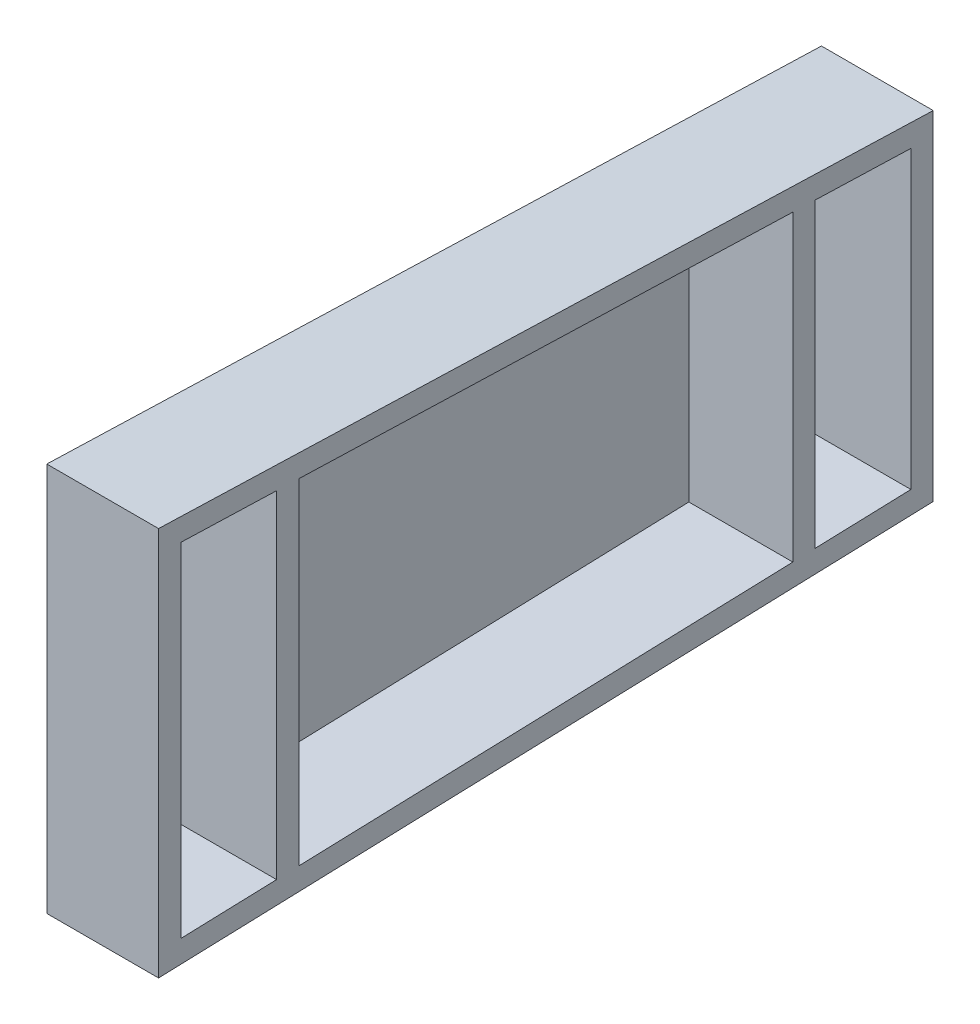
ISO-10303-21;
HEADER;
FILE_DESCRIPTION(('STEP AP214'),'2;1');
FILE_NAME('part.step','',(''),(''),'','','');
FILE_SCHEMA(('AUTOMOTIVE_DESIGN { 1 0 10303 214 1 1 1 1 }'));
ENDSEC;
DATA;
#1=APPLICATION_CONTEXT('core data for automotive mechanical design processes');
#2=APPLICATION_PROTOCOL_DEFINITION('international standard','automotive_design',2000,#1);
#3=PRODUCT_CONTEXT('',#1,'mechanical');
#4=PRODUCT('Part','Part','',(#3));
#5=PRODUCT_RELATED_PRODUCT_CATEGORY('part','',(#4));
#6=PRODUCT_DEFINITION_FORMATION('','',#4);
#7=PRODUCT_DEFINITION_CONTEXT('part definition',#1,'design');
#8=PRODUCT_DEFINITION('design','',#6,#7);
#9=PRODUCT_DEFINITION_SHAPE('','',#8);
#10=(LENGTH_UNIT() NAMED_UNIT(*) SI_UNIT(.MILLI.,.METRE.));
#11=(NAMED_UNIT(*) PLANE_ANGLE_UNIT() SI_UNIT($,.RADIAN.));
#12=(NAMED_UNIT(*) SI_UNIT($,.STERADIAN.) SOLID_ANGLE_UNIT());
#13=UNCERTAINTY_MEASURE_WITH_UNIT(LENGTH_MEASURE(1.E-05),#10,'distance_accuracy_value','');
#14=(GEOMETRIC_REPRESENTATION_CONTEXT(3) GLOBAL_UNCERTAINTY_ASSIGNED_CONTEXT((#13)) GLOBAL_UNIT_ASSIGNED_CONTEXT((#10,
#11,#12)) REPRESENTATION_CONTEXT('',''));
#15=CARTESIAN_POINT('',(0.,0.,0.));
#16=DIRECTION('',(0.,0.,1.));
#17=DIRECTION('',(1.,0.,0.));
#18=AXIS2_PLACEMENT_3D('',#15,#16,#17);
#19=CARTESIAN_POINT('',(3.,0.,0.));
#20=DIRECTION('',(1.,0.,0.));
#21=DIRECTION('',(0.,0.,-1.));
#22=AXIS2_PLACEMENT_3D('',#19,#20,#21);
#23=PLANE('',#22);
#24=DIRECTION('',(0.,0.0326503679022891,-0.999466834605253));
#25=VECTOR('',#24,1.);
#26=CARTESIAN_POINT('',(3.,-56.8109429530201,-289.4));
#27=LINE('',#26,#25);
#28=CARTESIAN_POINT('',(3.,-58.0131174496644,-252.6));
#29=VERTEX_POINT('',#28);
#30=CARTESIAN_POINT('',(3.,-56.8109429530201,-289.4));
#31=VERTEX_POINT('',#30);
#32=EDGE_CURVE('E188',#29,#31,#27,.T.);
#33=ORIENTED_EDGE('',*,*,#32,.T.);
#34=DIRECTION('',(0.,-1.,0.));
#35=VECTOR('',#34,1.);
#36=CARTESIAN_POINT('',(3.,56.8109429530201,-289.4));
#37=LINE('',#36,#35);
#38=CARTESIAN_POINT('',(3.,56.8109429530201,-289.4));
#39=VERTEX_POINT('',#38);
#40=EDGE_CURVE('E51',#39,#31,#37,.T.);
#41=ORIENTED_EDGE('',*,*,#40,.F.);
#42=DIRECTION('',(0.,-0.0326503679022891,-0.999466834605253));
#43=VECTOR('',#42,1.);
#44=CARTESIAN_POINT('',(3.,56.8109429530201,-289.4));
#45=LINE('',#44,#43);
#46=CARTESIAN_POINT('',(3.,58.0131174496644,-252.6));
#47=VERTEX_POINT('',#46);
#48=EDGE_CURVE('E55',#47,#39,#45,.T.);
#49=ORIENTED_EDGE('',*,*,#48,.F.);
#50=DIRECTION('',(0.,1.,0.));
#51=VECTOR('',#50,1.);
#52=CARTESIAN_POINT('',(3.,58.0131174496644,-252.6));
#53=LINE('',#52,#51);
#54=EDGE_CURVE('E246',#29,#47,#53,.T.);
#55=ORIENTED_EDGE('',*,*,#54,.F.);
#56=EDGE_LOOP('',(#33,#41,#49,#55));
#57=FACE_BOUND('',#56,.T.);
#58=ADVANCED_FACE('F36',(#57),#23,.T.);
#59=DIRECTION('',(0.,0.0326503679022891,-0.999466834605254));
#60=VECTOR('',#59,1.);
#61=CARTESIAN_POINT('',(3.,-58.2940604026846,-244.));
#62=LINE('',#61,#60);
#63=CARTESIAN_POINT('',(3.,-64.5009395973154,-54.));
#64=VERTEX_POINT('',#63);
#65=CARTESIAN_POINT('',(3.,-58.2940604026846,-244.));
#66=VERTEX_POINT('',#65);
#67=EDGE_CURVE('E179',#64,#66,#62,.T.);
#68=ORIENTED_EDGE('',*,*,#67,.T.);
#69=DIRECTION('',(0.,-1.,0.));
#70=VECTOR('',#69,1.);
#71=CARTESIAN_POINT('',(3.,58.2940604026846,-244.));
#72=LINE('',#71,#70);
#73=CARTESIAN_POINT('',(3.,58.2940604026846,-244.));
#74=VERTEX_POINT('',#73);
#75=EDGE_CURVE('E244',#74,#66,#72,.T.);
#76=ORIENTED_EDGE('',*,*,#75,.F.);
#77=DIRECTION('',(0.,-0.0326503679022891,-0.999466834605254));
#78=VECTOR('',#77,1.);
#79=CARTESIAN_POINT('',(3.,58.2940604026846,-244.));
#80=LINE('',#79,#78);
#81=CARTESIAN_POINT('',(3.,64.5009395973154,-54.));
#82=VERTEX_POINT('',#81);
#83=EDGE_CURVE('E241',#82,#74,#80,.T.);
#84=ORIENTED_EDGE('',*,*,#83,.F.);
#85=DIRECTION('',(0.,1.,0.));
#86=VECTOR('',#85,1.);
#87=CARTESIAN_POINT('',(3.,0.,-54.));
#88=LINE('',#87,#86);
#89=EDGE_CURVE('E238',#64,#82,#88,.T.);
#90=ORIENTED_EDGE('',*,*,#89,.F.);
#91=EDGE_LOOP('',(#68,#76,#84,#90));
#92=FACE_BOUND('',#91,.T.);
#93=ADVANCED_FACE('F288',(#92),#23,.T.);
#94=CARTESIAN_POINT('',(3.,-65.13,-298.));
#95=DIRECTION('',(0.,0.999466834605253,0.0326503679022891));
#96=DIRECTION('',(0.,-0.0326503679022891,0.999466834605254));
#97=AXIS2_PLACEMENT_3D('',#94,#95,#96);
#98=PLANE('',#97);
#99=DIRECTION('',(0.,0.0326503679022891,-0.999466834605254));
#100=VECTOR('',#99,1.);
#101=CARTESIAN_POINT('',(0.,-65.13,-298.));
#102=LINE('',#101,#100);
#103=CARTESIAN_POINT('',(0.,-74.865,0.));
#104=VERTEX_POINT('',#103);
#105=CARTESIAN_POINT('',(0.,-65.13,-298.));
#106=VERTEX_POINT('',#105);
#107=EDGE_CURVE('E267',#104,#106,#102,.T.);
#108=ORIENTED_EDGE('',*,*,#107,.T.);
#109=DIRECTION('',(-1.,0.,0.));
#110=VECTOR('',#109,1.);
#111=CARTESIAN_POINT('',(3.,-65.13,-298.));
#112=LINE('',#111,#110);
#113=CARTESIAN_POINT('',(43.,-65.13,-298.));
#114=VERTEX_POINT('',#113);
#115=EDGE_CURVE('E11',#114,#106,#112,.T.);
#116=ORIENTED_EDGE('',*,*,#115,.F.);
#117=DIRECTION('',(0.,-0.0326503679022891,0.999466834605254));
#118=VECTOR('',#117,1.);
#119=CARTESIAN_POINT('',(43.,-74.865,0.));
#120=LINE('',#119,#118);
#121=CARTESIAN_POINT('',(43.,-74.865,0.));
#122=VERTEX_POINT('',#121);
#123=EDGE_CURVE('E166',#114,#122,#120,.T.);
#124=ORIENTED_EDGE('',*,*,#123,.T.);
#125=DIRECTION('',(-1.,0.,0.));
#126=VECTOR('',#125,1.);
#127=CARTESIAN_POINT('',(3.,-74.865,0.));
#128=LINE('',#127,#126);
#129=EDGE_CURVE('E147',#122,#104,#128,.T.);
#130=ORIENTED_EDGE('',*,*,#129,.T.);
#131=EDGE_LOOP('',(#108,#116,#124,#130));
#132=FACE_BOUND('',#131,.T.);
#133=ADVANCED_FACE('F38',(#132),#98,.F.);
#134=CARTESIAN_POINT('',(3.,65.13,-298.));
#135=DIRECTION('',(0.,0.,1.));
#136=DIRECTION('',(1.,0.,0.));
#137=AXIS2_PLACEMENT_3D('',#134,#135,#136);
#138=PLANE('',#137);
#139=DIRECTION('',(0.,1.,0.));
#140=VECTOR('',#139,1.);
#141=CARTESIAN_POINT('',(0.,65.13,-298.));
#142=LINE('',#141,#140);
#143=CARTESIAN_POINT('',(0.,65.13,-298.));
#144=VERTEX_POINT('',#143);
#145=EDGE_CURVE('E269',#106,#144,#142,.T.);
#146=ORIENTED_EDGE('',*,*,#145,.T.);
#147=DIRECTION('',(-1.,0.,0.));
#148=VECTOR('',#147,1.);
#149=CARTESIAN_POINT('',(3.,65.13,-298.));
#150=LINE('',#149,#148);
#151=CARTESIAN_POINT('',(43.,65.13,-298.));
#152=VERTEX_POINT('',#151);
#153=EDGE_CURVE('E44',#152,#144,#150,.T.);
#154=ORIENTED_EDGE('',*,*,#153,.F.);
#155=DIRECTION('',(0.,1.,0.));
#156=VECTOR('',#155,1.);
#157=CARTESIAN_POINT('',(43.,0.,-298.));
#158=LINE('',#157,#156);
#159=EDGE_CURVE('E227',#114,#152,#158,.T.);
#160=ORIENTED_EDGE('',*,*,#159,.F.);
#161=ORIENTED_EDGE('',*,*,#115,.T.);
#162=EDGE_LOOP('',(#146,#154,#160,#161));
#163=FACE_BOUND('',#162,.T.);
#164=ADVANCED_FACE('F281',(#163),#138,.F.);
#165=CARTESIAN_POINT('',(3.,74.865,0.));
#166=DIRECTION('',(0.,-0.999466834605253,0.0326503679022891));
#167=DIRECTION('',(0.,-0.0326503679022891,-0.999466834605254));
#168=AXIS2_PLACEMENT_3D('',#165,#166,#167);
#169=PLANE('',#168);
#170=DIRECTION('',(0.,0.0326503679022891,0.999466834605254));
#171=VECTOR('',#170,1.);
#172=CARTESIAN_POINT('',(0.,74.865,0.));
#173=LINE('',#172,#171);
#174=CARTESIAN_POINT('',(0.,74.865,0.));
#175=VERTEX_POINT('',#174);
#176=EDGE_CURVE('E271',#144,#175,#173,.T.);
#177=ORIENTED_EDGE('',*,*,#176,.T.);
#178=DIRECTION('',(-1.,0.,0.));
#179=VECTOR('',#178,1.);
#180=CARTESIAN_POINT('',(3.,74.865,0.));
#181=LINE('',#180,#179);
#182=CARTESIAN_POINT('',(43.,74.865,0.));
#183=VERTEX_POINT('',#182);
#184=EDGE_CURVE('E158',#183,#175,#181,.T.);
#185=ORIENTED_EDGE('',*,*,#184,.F.);
#186=DIRECTION('',(0.,0.0326503679022891,0.999466834605254));
#187=VECTOR('',#186,1.);
#188=CARTESIAN_POINT('',(43.,74.865,0.));
#189=LINE('',#188,#187);
#190=EDGE_CURVE('E168',#152,#183,#189,.T.);
#191=ORIENTED_EDGE('',*,*,#190,.F.);
#192=ORIENTED_EDGE('',*,*,#153,.T.);
#193=EDGE_LOOP('',(#177,#185,#191,#192));
#194=FACE_BOUND('',#193,.T.);
#195=ADVANCED_FACE('F277',(#194),#169,.F.);
#196=CARTESIAN_POINT('',(3.,74.865,0.));
#197=DIRECTION('',(0.,0.,-1.));
#198=DIRECTION('',(-1.,0.,0.));
#199=AXIS2_PLACEMENT_3D('',#196,#197,#198);
#200=PLANE('',#199);
#201=ORIENTED_EDGE('',*,*,#129,.F.);
#202=DIRECTION('',(0.,-1.,0.));
#203=VECTOR('',#202,1.);
#204=CARTESIAN_POINT('',(43.,66.265,0.));
#205=LINE('',#204,#203);
#206=EDGE_CURVE('E151',#183,#122,#205,.T.);
#207=ORIENTED_EDGE('',*,*,#206,.F.);
#208=ORIENTED_EDGE('',*,*,#184,.T.);
#209=DIRECTION('',(0.,-1.,0.));
#210=VECTOR('',#209,1.);
#211=CARTESIAN_POINT('',(0.,74.865,0.));
#212=LINE('',#211,#210);
#213=EDGE_CURVE('E153',#175,#104,#212,.T.);
#214=ORIENTED_EDGE('',*,*,#213,.T.);
#215=EDGE_LOOP('',(#201,#207,#208,#214));
#216=FACE_BOUND('',#215,.T.);
#217=ADVANCED_FACE('F149',(#216),#200,.F.);
#218=DIRECTION('',(0.,0.0326503679022895,-0.999466834605253));
#219=VECTOR('',#218,1.);
#220=CARTESIAN_POINT('',(3.,-64.7818825503356,-45.4));
#221=LINE('',#220,#219);
#222=CARTESIAN_POINT('',(3.,-65.9840570469799,-8.60000000000001));
#223=VERTEX_POINT('',#222);
#224=CARTESIAN_POINT('',(3.,-64.7818825503356,-45.4));
#225=VERTEX_POINT('',#224);
#226=EDGE_CURVE('E173',#223,#225,#221,.T.);
#227=ORIENTED_EDGE('',*,*,#226,.T.);
#228=DIRECTION('',(0.,-1.,0.));
#229=VECTOR('',#228,1.);
#230=CARTESIAN_POINT('',(3.,0.,-45.4));
#231=LINE('',#230,#229);
#232=CARTESIAN_POINT('',(3.,64.7818825503356,-45.4));
#233=VERTEX_POINT('',#232);
#234=EDGE_CURVE('E236',#233,#225,#231,.T.);
#235=ORIENTED_EDGE('',*,*,#234,.F.);
#236=DIRECTION('',(0.,-0.0326503679022895,-0.999466834605253));
#237=VECTOR('',#236,1.);
#238=CARTESIAN_POINT('',(3.,64.7818825503356,-45.4));
#239=LINE('',#238,#237);
#240=CARTESIAN_POINT('',(3.,65.9840570469799,-8.60000000000001));
#241=VERTEX_POINT('',#240);
#242=EDGE_CURVE('E233',#241,#233,#239,.T.);
#243=ORIENTED_EDGE('',*,*,#242,.F.);
#244=DIRECTION('',(0.,1.,0.));
#245=VECTOR('',#244,1.);
#246=CARTESIAN_POINT('',(3.,0.,-8.60000000000001));
#247=LINE('',#246,#245);
#248=EDGE_CURVE('E208',#223,#241,#247,.T.);
#249=ORIENTED_EDGE('',*,*,#248,.F.);
#250=EDGE_LOOP('',(#227,#235,#243,#249));
#251=FACE_BOUND('',#250,.T.);
#252=ADVANCED_FACE('F291',(#251),#23,.T.);
#253=CARTESIAN_POINT('',(0.,0.,0.));
#254=DIRECTION('',(1.,0.,0.));
#255=DIRECTION('',(0.,0.,-1.));
#256=AXIS2_PLACEMENT_3D('',#253,#254,#255);
#257=PLANE('',#256);
#258=ORIENTED_EDGE('',*,*,#107,.F.);
#259=ORIENTED_EDGE('',*,*,#213,.F.);
#260=ORIENTED_EDGE('',*,*,#176,.F.);
#261=ORIENTED_EDGE('',*,*,#145,.F.);
#262=EDGE_LOOP('',(#258,#259,#260,#261));
#263=FACE_BOUND('',#262,.T.);
#264=ADVANCED_FACE('F280',(#263),#257,.F.);
#265=CARTESIAN_POINT('',(43.,0.,-8.60000000000001));
#266=DIRECTION('',(0.,0.,1.));
#267=DIRECTION('',(1.,0.,0.));
#268=AXIS2_PLACEMENT_3D('',#265,#266,#267);
#269=PLANE('',#268);
#270=ORIENTED_EDGE('',*,*,#248,.T.);
#271=DIRECTION('',(-1.,0.,0.));
#272=VECTOR('',#271,1.);
#273=CARTESIAN_POINT('',(43.,65.9840570469799,-8.60000000000001));
#274=LINE('',#273,#272);
#275=CARTESIAN_POINT('',(43.,65.9840570469799,-8.60000000000001));
#276=VERTEX_POINT('',#275);
#277=EDGE_CURVE('E264',#276,#241,#274,.T.);
#278=ORIENTED_EDGE('',*,*,#277,.F.);
#279=DIRECTION('',(0.,1.,0.));
#280=VECTOR('',#279,1.);
#281=CARTESIAN_POINT('',(43.,0.,-8.60000000000001));
#282=LINE('',#281,#280);
#283=CARTESIAN_POINT('',(43.,-65.9840570469799,-8.60000000000001));
#284=VERTEX_POINT('',#283);
#285=EDGE_CURVE('E169',#284,#276,#282,.T.);
#286=ORIENTED_EDGE('',*,*,#285,.F.);
#287=DIRECTION('',(-1.,0.,0.));
#288=VECTOR('',#287,1.);
#289=CARTESIAN_POINT('',(43.,-65.9840570469799,-8.60000000000001));
#290=LINE('',#289,#288);
#291=EDGE_CURVE('E187',#284,#223,#290,.T.);
#292=ORIENTED_EDGE('',*,*,#291,.T.);
#293=EDGE_LOOP('',(#270,#278,#286,#292));
#294=FACE_BOUND('',#293,.T.);
#295=ADVANCED_FACE('F304',(#294),#269,.F.);
#296=CARTESIAN_POINT('',(43.,64.7818825503356,-45.4));
#297=DIRECTION('',(0.,0.999466834605254,-0.0326503679022895));
#298=DIRECTION('',(0.,0.0326503679022895,0.999466834605254));
#299=AXIS2_PLACEMENT_3D('',#296,#297,#298);
#300=PLANE('',#299);
#301=ORIENTED_EDGE('',*,*,#242,.T.);
#302=DIRECTION('',(-1.,0.,0.));
#303=VECTOR('',#302,1.);
#304=CARTESIAN_POINT('',(43.,64.7818825503356,-45.4));
#305=LINE('',#304,#303);
#306=CARTESIAN_POINT('',(43.,64.7818825503356,-45.4));
#307=VERTEX_POINT('',#306);
#308=EDGE_CURVE('E261',#307,#233,#305,.T.);
#309=ORIENTED_EDGE('',*,*,#308,.F.);
#310=DIRECTION('',(0.,-0.0326503679022895,-0.999466834605253));
#311=VECTOR('',#310,1.);
#312=CARTESIAN_POINT('',(43.,64.7818825503356,-45.4));
#313=LINE('',#312,#311);
#314=EDGE_CURVE('E211',#276,#307,#313,.T.);
#315=ORIENTED_EDGE('',*,*,#314,.F.);
#316=ORIENTED_EDGE('',*,*,#277,.T.);
#317=EDGE_LOOP('',(#301,#309,#315,#316));
#318=FACE_BOUND('',#317,.T.);
#319=ADVANCED_FACE('F318',(#318),#300,.F.);
#320=CARTESIAN_POINT('',(43.,0.,-45.4));
#321=DIRECTION('',(0.,0.,-1.));
#322=DIRECTION('',(-1.,0.,0.));
#323=AXIS2_PLACEMENT_3D('',#320,#321,#322);
#324=PLANE('',#323);
#325=ORIENTED_EDGE('',*,*,#234,.T.);
#326=DIRECTION('',(-1.,0.,0.));
#327=VECTOR('',#326,1.);
#328=CARTESIAN_POINT('',(43.,-64.7818825503356,-45.4));
#329=LINE('',#328,#327);
#330=CARTESIAN_POINT('',(43.,-64.7818825503356,-45.4));
#331=VERTEX_POINT('',#330);
#332=EDGE_CURVE('E194',#331,#225,#329,.T.);
#333=ORIENTED_EDGE('',*,*,#332,.F.);
#334=DIRECTION('',(0.,-1.,0.));
#335=VECTOR('',#334,1.);
#336=CARTESIAN_POINT('',(43.,0.,-45.4));
#337=LINE('',#336,#335);
#338=EDGE_CURVE('E213',#307,#331,#337,.T.);
#339=ORIENTED_EDGE('',*,*,#338,.F.);
#340=ORIENTED_EDGE('',*,*,#308,.T.);
#341=EDGE_LOOP('',(#325,#333,#339,#340));
#342=FACE_BOUND('',#341,.T.);
#343=ADVANCED_FACE('F314',(#342),#324,.F.);
#344=CARTESIAN_POINT('',(43.,0.,-54.));
#345=DIRECTION('',(0.,0.,1.));
#346=DIRECTION('',(1.,0.,0.));
#347=AXIS2_PLACEMENT_3D('',#344,#345,#346);
#348=PLANE('',#347);
#349=ORIENTED_EDGE('',*,*,#89,.T.);
#350=DIRECTION('',(-1.,0.,0.));
#351=VECTOR('',#350,1.);
#352=CARTESIAN_POINT('',(43.,64.5009395973154,-54.));
#353=LINE('',#352,#351);
#354=CARTESIAN_POINT('',(43.,64.5009395973154,-54.));
#355=VERTEX_POINT('',#354);
#356=EDGE_CURVE('E258',#355,#82,#353,.T.);
#357=ORIENTED_EDGE('',*,*,#356,.F.);
#358=DIRECTION('',(0.,1.,0.));
#359=VECTOR('',#358,1.);
#360=CARTESIAN_POINT('',(43.,0.,-54.));
#361=LINE('',#360,#359);
#362=CARTESIAN_POINT('',(43.,-64.5009395973154,-54.));
#363=VERTEX_POINT('',#362);
#364=EDGE_CURVE('E215',#363,#355,#361,.T.);
#365=ORIENTED_EDGE('',*,*,#364,.F.);
#366=DIRECTION('',(-1.,0.,0.));
#367=VECTOR('',#366,1.);
#368=CARTESIAN_POINT('',(43.,-64.5009395973154,-54.));
#369=LINE('',#368,#367);
#370=EDGE_CURVE('E197',#363,#64,#369,.T.);
#371=ORIENTED_EDGE('',*,*,#370,.T.);
#372=EDGE_LOOP('',(#349,#357,#365,#371));
#373=FACE_BOUND('',#372,.T.);
#374=ADVANCED_FACE('F352',(#373),#348,.F.);
#375=CARTESIAN_POINT('',(43.,58.2940604026846,-244.));
#376=DIRECTION('',(0.,0.999466834605254,-0.0326503679022891));
#377=DIRECTION('',(0.,0.0326503679022891,0.999466834605254));
#378=AXIS2_PLACEMENT_3D('',#375,#376,#377);
#379=PLANE('',#378);
#380=ORIENTED_EDGE('',*,*,#83,.T.);
#381=DIRECTION('',(-1.,0.,0.));
#382=VECTOR('',#381,1.);
#383=CARTESIAN_POINT('',(43.,58.2940604026846,-244.));
#384=LINE('',#383,#382);
#385=CARTESIAN_POINT('',(43.,58.2940604026846,-244.));
#386=VERTEX_POINT('',#385);
#387=EDGE_CURVE('E255',#386,#74,#384,.T.);
#388=ORIENTED_EDGE('',*,*,#387,.F.);
#389=DIRECTION('',(0.,-0.0326503679022891,-0.999466834605254));
#390=VECTOR('',#389,1.);
#391=CARTESIAN_POINT('',(43.,58.2940604026846,-244.));
#392=LINE('',#391,#390);
#393=EDGE_CURVE('E217',#355,#386,#392,.T.);
#394=ORIENTED_EDGE('',*,*,#393,.F.);
#395=ORIENTED_EDGE('',*,*,#356,.T.);
#396=EDGE_LOOP('',(#380,#388,#394,#395));
#397=FACE_BOUND('',#396,.T.);
#398=ADVANCED_FACE('F348',(#397),#379,.F.);
#399=CARTESIAN_POINT('',(43.,58.2940604026846,-244.));
#400=DIRECTION('',(0.,0.,-1.));
#401=DIRECTION('',(-1.,0.,0.));
#402=AXIS2_PLACEMENT_3D('',#399,#400,#401);
#403=PLANE('',#402);
#404=ORIENTED_EDGE('',*,*,#75,.T.);
#405=DIRECTION('',(-1.,0.,0.));
#406=VECTOR('',#405,1.);
#407=CARTESIAN_POINT('',(43.,-58.2940604026846,-244.));
#408=LINE('',#407,#406);
#409=CARTESIAN_POINT('',(43.,-58.2940604026846,-244.));
#410=VERTEX_POINT('',#409);
#411=EDGE_CURVE('E200',#410,#66,#408,.T.);
#412=ORIENTED_EDGE('',*,*,#411,.F.);
#413=DIRECTION('',(0.,-1.,0.));
#414=VECTOR('',#413,1.);
#415=CARTESIAN_POINT('',(43.,58.2940604026846,-244.));
#416=LINE('',#415,#414);
#417=EDGE_CURVE('E219',#386,#410,#416,.T.);
#418=ORIENTED_EDGE('',*,*,#417,.F.);
#419=ORIENTED_EDGE('',*,*,#387,.T.);
#420=EDGE_LOOP('',(#404,#412,#418,#419));
#421=FACE_BOUND('',#420,.T.);
#422=ADVANCED_FACE('F344',(#421),#403,.F.);
#423=CARTESIAN_POINT('',(43.,58.0131174496644,-252.6));
#424=DIRECTION('',(0.,0.,1.));
#425=DIRECTION('',(1.,0.,0.));
#426=AXIS2_PLACEMENT_3D('',#423,#424,#425);
#427=PLANE('',#426);
#428=ORIENTED_EDGE('',*,*,#54,.T.);
#429=DIRECTION('',(-1.,0.,0.));
#430=VECTOR('',#429,1.);
#431=CARTESIAN_POINT('',(43.,58.0131174496644,-252.6));
#432=LINE('',#431,#430);
#433=CARTESIAN_POINT('',(43.,58.0131174496644,-252.6));
#434=VERTEX_POINT('',#433);
#435=EDGE_CURVE('E252',#434,#47,#432,.T.);
#436=ORIENTED_EDGE('',*,*,#435,.F.);
#437=DIRECTION('',(0.,1.,0.));
#438=VECTOR('',#437,1.);
#439=CARTESIAN_POINT('',(43.,58.0131174496644,-252.6));
#440=LINE('',#439,#438);
#441=CARTESIAN_POINT('',(43.,-58.0131174496644,-252.6));
#442=VERTEX_POINT('',#441);
#443=EDGE_CURVE('E221',#442,#434,#440,.T.);
#444=ORIENTED_EDGE('',*,*,#443,.F.);
#445=DIRECTION('',(-1.,0.,0.));
#446=VECTOR('',#445,1.);
#447=CARTESIAN_POINT('',(43.,-58.0131174496644,-252.6));
#448=LINE('',#447,#446);
#449=EDGE_CURVE('E203',#442,#29,#448,.T.);
#450=ORIENTED_EDGE('',*,*,#449,.T.);
#451=EDGE_LOOP('',(#428,#436,#444,#450));
#452=FACE_BOUND('',#451,.T.);
#453=ADVANCED_FACE('F340',(#452),#427,.F.);
#454=CARTESIAN_POINT('',(43.,56.8109429530201,-289.4));
#455=DIRECTION('',(0.,0.999466834605254,-0.0326503679022891));
#456=DIRECTION('',(0.,0.0326503679022891,0.999466834605254));
#457=AXIS2_PLACEMENT_3D('',#454,#455,#456);
#458=PLANE('',#457);
#459=ORIENTED_EDGE('',*,*,#48,.T.);
#460=DIRECTION('',(-1.,0.,0.));
#461=VECTOR('',#460,1.);
#462=CARTESIAN_POINT('',(43.,56.8109429530201,-289.4));
#463=LINE('',#462,#461);
#464=CARTESIAN_POINT('',(43.,56.8109429530201,-289.4));
#465=VERTEX_POINT('',#464);
#466=EDGE_CURVE('E230',#465,#39,#463,.T.);
#467=ORIENTED_EDGE('',*,*,#466,.F.);
#468=DIRECTION('',(0.,-0.0326503679022891,-0.999466834605253));
#469=VECTOR('',#468,1.);
#470=CARTESIAN_POINT('',(43.,56.8109429530201,-289.4));
#471=LINE('',#470,#469);
#472=EDGE_CURVE('E223',#434,#465,#471,.T.);
#473=ORIENTED_EDGE('',*,*,#472,.F.);
#474=ORIENTED_EDGE('',*,*,#435,.T.);
#475=EDGE_LOOP('',(#459,#467,#473,#474));
#476=FACE_BOUND('',#475,.T.);
#477=ADVANCED_FACE('F333',(#476),#458,.F.);
#478=CARTESIAN_POINT('',(43.,56.8109429530201,-289.4));
#479=DIRECTION('',(0.,0.,-1.));
#480=DIRECTION('',(-1.,0.,0.));
#481=AXIS2_PLACEMENT_3D('',#478,#479,#480);
#482=PLANE('',#481);
#483=ORIENTED_EDGE('',*,*,#40,.T.);
#484=DIRECTION('',(-1.,0.,0.));
#485=VECTOR('',#484,1.);
#486=CARTESIAN_POINT('',(43.,-56.8109429530201,-289.4));
#487=LINE('',#486,#485);
#488=CARTESIAN_POINT('',(43.,-56.8109429530201,-289.4));
#489=VERTEX_POINT('',#488);
#490=EDGE_CURVE('E206',#489,#31,#487,.T.);
#491=ORIENTED_EDGE('',*,*,#490,.F.);
#492=DIRECTION('',(0.,-1.,0.));
#493=VECTOR('',#492,1.);
#494=CARTESIAN_POINT('',(43.,56.8109429530201,-289.4));
#495=LINE('',#494,#493);
#496=EDGE_CURVE('E225',#465,#489,#495,.T.);
#497=ORIENTED_EDGE('',*,*,#496,.F.);
#498=ORIENTED_EDGE('',*,*,#466,.T.);
#499=EDGE_LOOP('',(#483,#491,#497,#498));
#500=FACE_BOUND('',#499,.T.);
#501=ADVANCED_FACE('F324',(#500),#482,.F.);
#502=CARTESIAN_POINT('',(43.,0.,0.));
#503=DIRECTION('',(-1.,0.,0.));
#504=DIRECTION('',(0.,0.,1.));
#505=AXIS2_PLACEMENT_3D('',#502,#503,#504);
#506=PLANE('',#505);
#507=ORIENTED_EDGE('',*,*,#123,.F.);
#508=ORIENTED_EDGE('',*,*,#159,.T.);
#509=ORIENTED_EDGE('',*,*,#190,.T.);
#510=ORIENTED_EDGE('',*,*,#206,.T.);
#511=EDGE_LOOP('',(#507,#508,#509,#510));
#512=FACE_BOUND('',#511,.T.);
#513=DIRECTION('',(0.,0.0326503679022891,-0.999466834605253));
#514=VECTOR('',#513,1.);
#515=CARTESIAN_POINT('',(43.,-56.8109429530201,-289.4));
#516=LINE('',#515,#514);
#517=EDGE_CURVE('E172',#442,#489,#516,.T.);
#518=ORIENTED_EDGE('',*,*,#517,.F.);
#519=ORIENTED_EDGE('',*,*,#443,.T.);
#520=ORIENTED_EDGE('',*,*,#472,.T.);
#521=ORIENTED_EDGE('',*,*,#496,.T.);
#522=EDGE_LOOP('',(#518,#519,#520,#521));
#523=FACE_BOUND('',#522,.T.);
#524=DIRECTION('',(0.,0.0326503679022891,-0.999466834605254));
#525=VECTOR('',#524,1.);
#526=CARTESIAN_POINT('',(43.,-58.2940604026846,-244.));
#527=LINE('',#526,#525);
#528=EDGE_CURVE('E176',#363,#410,#527,.T.);
#529=ORIENTED_EDGE('',*,*,#528,.F.);
#530=ORIENTED_EDGE('',*,*,#364,.T.);
#531=ORIENTED_EDGE('',*,*,#393,.T.);
#532=ORIENTED_EDGE('',*,*,#417,.T.);
#533=EDGE_LOOP('',(#529,#530,#531,#532));
#534=FACE_BOUND('',#533,.T.);
#535=ORIENTED_EDGE('',*,*,#338,.T.);
#536=DIRECTION('',(0.,0.0326503679022895,-0.999466834605253));
#537=VECTOR('',#536,1.);
#538=CARTESIAN_POINT('',(43.,-64.7818825503356,-45.4));
#539=LINE('',#538,#537);
#540=EDGE_CURVE('E184',#284,#331,#539,.T.);
#541=ORIENTED_EDGE('',*,*,#540,.F.);
#542=ORIENTED_EDGE('',*,*,#285,.T.);
#543=ORIENTED_EDGE('',*,*,#314,.T.);
#544=EDGE_LOOP('',(#535,#541,#542,#543));
#545=FACE_BOUND('',#544,.T.);
#546=ADVANCED_FACE('F163',(#512,#523,#534,#545),#506,.F.);
#547=CARTESIAN_POINT('',(43.,-56.8109429530201,-289.4));
#548=DIRECTION('',(0.,0.999466834605254,0.0326503679022891));
#549=DIRECTION('',(0.,-0.0326503679022891,0.999466834605254));
#550=AXIS2_PLACEMENT_3D('',#547,#548,#549);
#551=PLANE('',#550);
#552=ORIENTED_EDGE('',*,*,#32,.F.);
#553=ORIENTED_EDGE('',*,*,#449,.F.);
#554=ORIENTED_EDGE('',*,*,#517,.T.);
#555=ORIENTED_EDGE('',*,*,#490,.T.);
#556=EDGE_LOOP('',(#552,#553,#554,#555));
#557=FACE_BOUND('',#556,.T.);
#558=ADVANCED_FACE('F323',(#557),#551,.T.);
#559=CARTESIAN_POINT('',(43.,-58.2940604026846,-244.));
#560=DIRECTION('',(0.,0.999466834605254,0.0326503679022891));
#561=DIRECTION('',(0.,-0.0326503679022891,0.999466834605254));
#562=AXIS2_PLACEMENT_3D('',#559,#560,#561);
#563=PLANE('',#562);
#564=ORIENTED_EDGE('',*,*,#67,.F.);
#565=ORIENTED_EDGE('',*,*,#370,.F.);
#566=ORIENTED_EDGE('',*,*,#528,.T.);
#567=ORIENTED_EDGE('',*,*,#411,.T.);
#568=EDGE_LOOP('',(#564,#565,#566,#567));
#569=FACE_BOUND('',#568,.T.);
#570=ADVANCED_FACE('F330',(#569),#563,.T.);
#571=CARTESIAN_POINT('',(43.,-64.7818825503356,-45.4));
#572=DIRECTION('',(0.,0.999466834605254,0.0326503679022895));
#573=DIRECTION('',(0.,-0.0326503679022895,0.999466834605254));
#574=AXIS2_PLACEMENT_3D('',#571,#572,#573);
#575=PLANE('',#574);
#576=ORIENTED_EDGE('',*,*,#226,.F.);
#577=ORIENTED_EDGE('',*,*,#291,.F.);
#578=ORIENTED_EDGE('',*,*,#540,.T.);
#579=ORIENTED_EDGE('',*,*,#332,.T.);
#580=EDGE_LOOP('',(#576,#577,#578,#579));
#581=FACE_BOUND('',#580,.T.);
#582=ADVANCED_FACE('F309',(#581),#575,.T.);
#583=CLOSED_SHELL('',(#58,#93,#133,#164,#195,#217,#252,#264,#295,#319,#343,#374,#398,#422,#453,
#477,#501,#546,#558,#570,#582));
#584=MANIFOLD_SOLID_BREP('B2',#583);
#585=ADVANCED_BREP_SHAPE_REPRESENTATION('',(#18,#584),#14);
#586=SHAPE_DEFINITION_REPRESENTATION(#9,#585);
ENDSEC;
END-ISO-10303-21;
